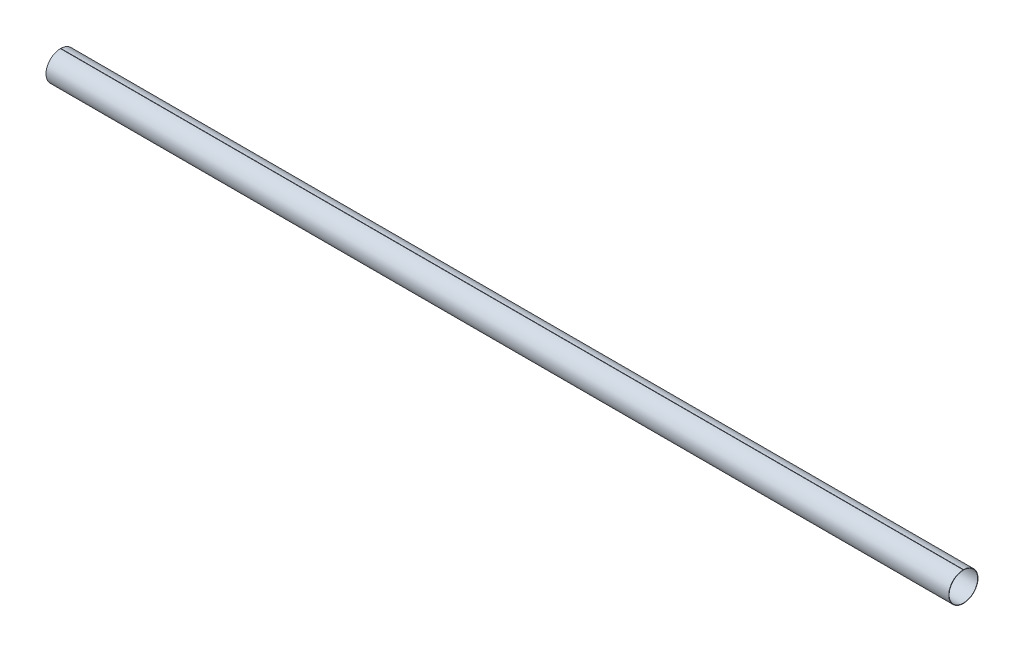
ISO-10303-21;
HEADER;
FILE_DESCRIPTION(('STEP AP214'),'2;1');
FILE_NAME('part.step','',(''),(''),'','','');
FILE_SCHEMA(('AUTOMOTIVE_DESIGN { 1 0 10303 214 1 1 1 1 }'));
ENDSEC;
DATA;
#1=APPLICATION_CONTEXT('core data for automotive mechanical design processes');
#2=APPLICATION_PROTOCOL_DEFINITION('international standard','automotive_design',2000,#1);
#3=PRODUCT_CONTEXT('',#1,'mechanical');
#4=PRODUCT('Part','Part','',(#3));
#5=PRODUCT_RELATED_PRODUCT_CATEGORY('part','',(#4));
#6=PRODUCT_DEFINITION_FORMATION('','',#4);
#7=PRODUCT_DEFINITION_CONTEXT('part definition',#1,'design');
#8=PRODUCT_DEFINITION('design','',#6,#7);
#9=PRODUCT_DEFINITION_SHAPE('','',#8);
#10=(LENGTH_UNIT() NAMED_UNIT(*) SI_UNIT(.MILLI.,.METRE.));
#11=(NAMED_UNIT(*) PLANE_ANGLE_UNIT() SI_UNIT($,.RADIAN.));
#12=(NAMED_UNIT(*) SI_UNIT($,.STERADIAN.) SOLID_ANGLE_UNIT());
#13=UNCERTAINTY_MEASURE_WITH_UNIT(LENGTH_MEASURE(1.E-05),#10,'distance_accuracy_value','');
#14=(GEOMETRIC_REPRESENTATION_CONTEXT(3) GLOBAL_UNCERTAINTY_ASSIGNED_CONTEXT((#13)) GLOBAL_UNIT_ASSIGNED_CONTEXT((#10,
#11,#12)) REPRESENTATION_CONTEXT('',''));
#15=CARTESIAN_POINT('',(0.,0.,0.));
#16=DIRECTION('',(0.,0.,1.));
#17=DIRECTION('',(1.,0.,0.));
#18=AXIS2_PLACEMENT_3D('',#15,#16,#17);
#19=CARTESIAN_POINT('',(2500.,0.,0.));
#20=DIRECTION('',(-1.,0.,0.));
#21=DIRECTION('',(0.,0.,1.));
#22=AXIS2_PLACEMENT_3D('',#19,#20,#21);
#23=CYLINDRICAL_SURFACE('',#22,40.5);
#24=CARTESIAN_POINT('',(0.,0.,0.));
#25=DIRECTION('',(1.,0.,0.));
#26=DIRECTION('',(0.,0.,-1.));
#27=AXIS2_PLACEMENT_3D('',#24,#25,#26);
#28=CIRCLE('',#27,40.5);
#29=CARTESIAN_POINT('',(0.,40.4969134626332,0.499999999999997));
#30=VERTEX_POINT('',#29);
#31=CARTESIAN_POINT('',(0.,40.4969134626332,-0.500000000000003));
#32=VERTEX_POINT('',#31);
#33=EDGE_CURVE('E107',#30,#32,#28,.T.);
#34=ORIENTED_EDGE('',*,*,#33,.T.);
#35=DIRECTION('',(-1.,0.,0.));
#36=VECTOR('',#35,1.);
#37=CARTESIAN_POINT('',(2500.,40.4969134626332,-0.500000000000003));
#38=LINE('',#37,#36);
#39=CARTESIAN_POINT('',(2500.,40.4969134626332,-0.500000000000003));
#40=VERTEX_POINT('',#39);
#41=EDGE_CURVE('E11',#40,#32,#38,.T.);
#42=ORIENTED_EDGE('',*,*,#41,.F.);
#43=CARTESIAN_POINT('',(2500.,0.,0.));
#44=DIRECTION('',(1.,0.,0.));
#45=DIRECTION('',(0.,0.,-1.));
#46=AXIS2_PLACEMENT_3D('',#43,#44,#45);
#47=CIRCLE('',#46,40.5);
#48=CARTESIAN_POINT('',(2500.,40.4969134626332,0.499999999999997));
#49=VERTEX_POINT('',#48);
#50=EDGE_CURVE('E91',#49,#40,#47,.T.);
#51=ORIENTED_EDGE('',*,*,#50,.F.);
#52=DIRECTION('',(-1.,0.,0.));
#53=VECTOR('',#52,1.);
#54=CARTESIAN_POINT('',(2500.,40.4969134626332,0.499999999999997));
#55=LINE('',#54,#53);
#56=EDGE_CURVE('E103',#49,#30,#55,.T.);
#57=ORIENTED_EDGE('',*,*,#56,.T.);
#58=EDGE_LOOP('',(#34,#42,#51,#57));
#59=FACE_BOUND('',#58,.T.);
#60=ADVANCED_FACE('F39',(#59),#23,.T.);
#61=CARTESIAN_POINT('',(2500.,40.4969134626332,-0.500000000000003));
#62=DIRECTION('',(0.,0.,-1.));
#63=DIRECTION('',(0.,1.,0.));
#64=AXIS2_PLACEMENT_3D('',#61,#62,#63);
#65=PLANE('',#64);
#66=DIRECTION('',(0.,-1.,0.));
#67=VECTOR('',#66,1.);
#68=CARTESIAN_POINT('',(0.,40.4969134626332,-0.500000000000003));
#69=LINE('',#68,#67);
#70=CARTESIAN_POINT('',(0.,39.496835316263,-0.500000000000003));
#71=VERTEX_POINT('',#70);
#72=EDGE_CURVE('E96',#32,#71,#69,.T.);
#73=ORIENTED_EDGE('',*,*,#72,.T.);
#74=DIRECTION('',(-1.,0.,0.));
#75=VECTOR('',#74,1.);
#76=CARTESIAN_POINT('',(2500.,39.496835316263,-0.500000000000003));
#77=LINE('',#76,#75);
#78=CARTESIAN_POINT('',(2500.,39.496835316263,-0.500000000000003));
#79=VERTEX_POINT('',#78);
#80=EDGE_CURVE('E48',#79,#71,#77,.T.);
#81=ORIENTED_EDGE('',*,*,#80,.F.);
#82=DIRECTION('',(0.,-1.,0.));
#83=VECTOR('',#82,1.);
#84=CARTESIAN_POINT('',(2500.,40.4969134626332,-0.500000000000003));
#85=LINE('',#84,#83);
#86=EDGE_CURVE('E86',#40,#79,#85,.T.);
#87=ORIENTED_EDGE('',*,*,#86,.F.);
#88=ORIENTED_EDGE('',*,*,#41,.T.);
#89=EDGE_LOOP('',(#73,#81,#87,#88));
#90=FACE_BOUND('',#89,.T.);
#91=ADVANCED_FACE('F95',(#90),#65,.F.);
#92=CARTESIAN_POINT('',(2500.,0.,0.));
#93=DIRECTION('',(-1.,0.,0.));
#94=DIRECTION('',(0.,0.,1.));
#95=AXIS2_PLACEMENT_3D('',#92,#93,#94);
#96=CYLINDRICAL_SURFACE('',#95,39.5);
#97=CARTESIAN_POINT('',(0.,0.,0.));
#98=DIRECTION('',(-1.,0.,0.));
#99=DIRECTION('',(0.,0.,-1.));
#100=AXIS2_PLACEMENT_3D('',#97,#98,#99);
#101=CIRCLE('',#100,39.5);
#102=CARTESIAN_POINT('',(0.,39.496835316263,0.499999999999999));
#103=VERTEX_POINT('',#102);
#104=EDGE_CURVE('E73',#71,#103,#101,.T.);
#105=ORIENTED_EDGE('',*,*,#104,.T.);
#106=DIRECTION('',(-1.,0.,0.));
#107=VECTOR('',#106,1.);
#108=CARTESIAN_POINT('',(2500.,39.496835316263,0.499999999999999));
#109=LINE('',#108,#107);
#110=CARTESIAN_POINT('',(2500.,39.496835316263,0.499999999999999));
#111=VERTEX_POINT('',#110);
#112=EDGE_CURVE('E98',#111,#103,#109,.T.);
#113=ORIENTED_EDGE('',*,*,#112,.F.);
#114=CARTESIAN_POINT('',(2500.,0.,0.));
#115=DIRECTION('',(-1.,0.,0.));
#116=DIRECTION('',(0.,0.,-1.));
#117=AXIS2_PLACEMENT_3D('',#114,#115,#116);
#118=CIRCLE('',#117,39.5);
#119=EDGE_CURVE('E89',#79,#111,#118,.T.);
#120=ORIENTED_EDGE('',*,*,#119,.F.);
#121=ORIENTED_EDGE('',*,*,#80,.T.);
#122=EDGE_LOOP('',(#105,#113,#120,#121));
#123=FACE_BOUND('',#122,.T.);
#124=ADVANCED_FACE('F99',(#123),#96,.F.);
#125=CARTESIAN_POINT('',(2500.,40.4969134626332,0.499999999999997));
#126=DIRECTION('',(0.,0.,1.));
#127=DIRECTION('',(0.,-1.,0.));
#128=AXIS2_PLACEMENT_3D('',#125,#126,#127);
#129=PLANE('',#128);
#130=DIRECTION('',(0.,1.,0.));
#131=VECTOR('',#130,1.);
#132=CARTESIAN_POINT('',(0.,40.4969134626332,0.499999999999997));
#133=LINE('',#132,#131);
#134=EDGE_CURVE('E79',#103,#30,#133,.T.);
#135=ORIENTED_EDGE('',*,*,#134,.T.);
#136=ORIENTED_EDGE('',*,*,#56,.F.);
#137=DIRECTION('',(0.,1.,0.));
#138=VECTOR('',#137,1.);
#139=CARTESIAN_POINT('',(2500.,40.4969134626332,0.499999999999997));
#140=LINE('',#139,#138);
#141=EDGE_CURVE('E56',#111,#49,#140,.T.);
#142=ORIENTED_EDGE('',*,*,#141,.F.);
#143=ORIENTED_EDGE('',*,*,#112,.T.);
#144=EDGE_LOOP('',(#135,#136,#142,#143));
#145=FACE_BOUND('',#144,.T.);
#146=ADVANCED_FACE('F120',(#145),#129,.F.);
#147=CARTESIAN_POINT('',(2500.,0.,0.));
#148=DIRECTION('',(1.,0.,0.));
#149=DIRECTION('',(0.,0.,-1.));
#150=AXIS2_PLACEMENT_3D('',#147,#148,#149);
#151=PLANE('',#150);
#152=ORIENTED_EDGE('',*,*,#50,.T.);
#153=ORIENTED_EDGE('',*,*,#86,.T.);
#154=ORIENTED_EDGE('',*,*,#119,.T.);
#155=ORIENTED_EDGE('',*,*,#141,.T.);
#156=EDGE_LOOP('',(#152,#153,#154,#155));
#157=FACE_BOUND('',#156,.T.);
#158=ADVANCED_FACE('F87',(#157),#151,.T.);
#159=CARTESIAN_POINT('',(0.,0.,0.));
#160=DIRECTION('',(1.,0.,0.));
#161=DIRECTION('',(0.,0.,-1.));
#162=AXIS2_PLACEMENT_3D('',#159,#160,#161);
#163=PLANE('',#162);
#164=ORIENTED_EDGE('',*,*,#33,.F.);
#165=ORIENTED_EDGE('',*,*,#134,.F.);
#166=ORIENTED_EDGE('',*,*,#104,.F.);
#167=ORIENTED_EDGE('',*,*,#72,.F.);
#168=EDGE_LOOP('',(#164,#165,#166,#167));
#169=FACE_BOUND('',#168,.T.);
#170=ADVANCED_FACE('F123',(#169),#163,.F.);
#171=CLOSED_SHELL('',(#60,#91,#124,#146,#158,#170));
#172=MANIFOLD_SOLID_BREP('B2',#171);
#173=ADVANCED_BREP_SHAPE_REPRESENTATION('',(#18,#172),#14);
#174=SHAPE_DEFINITION_REPRESENTATION(#9,#173);
ENDSEC;
END-ISO-10303-21;
